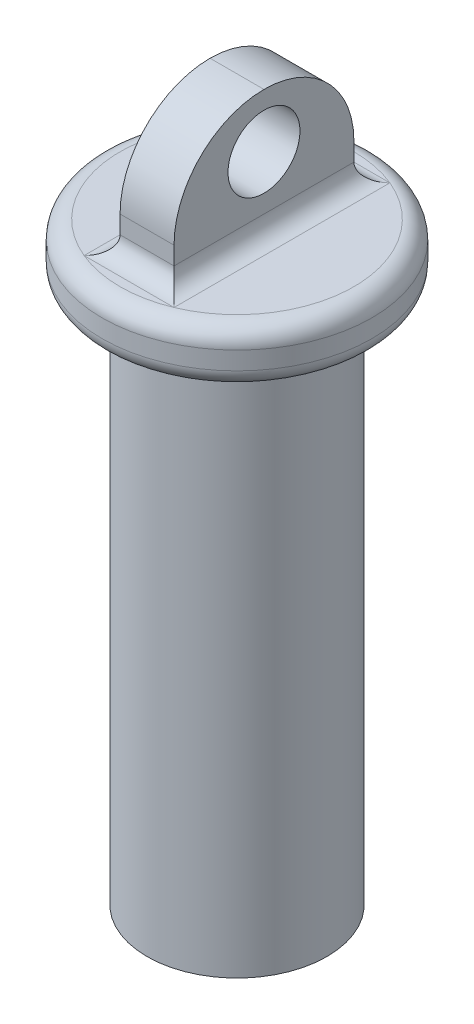
ISO-10303-21;
HEADER;
FILE_DESCRIPTION(('STEP AP214'),'2;1');
FILE_NAME('part.step','',(''),(''),'','','');
FILE_SCHEMA(('AUTOMOTIVE_DESIGN { 1 0 10303 214 1 1 1 1 }'));
ENDSEC;
DATA;
#1=APPLICATION_CONTEXT('core data for automotive mechanical design processes');
#2=APPLICATION_PROTOCOL_DEFINITION('international standard','automotive_design',2000,#1);
#3=PRODUCT_CONTEXT('',#1,'mechanical');
#4=PRODUCT('Part','Part','',(#3));
#5=PRODUCT_RELATED_PRODUCT_CATEGORY('part','',(#4));
#6=PRODUCT_DEFINITION_FORMATION('','',#4);
#7=PRODUCT_DEFINITION_CONTEXT('part definition',#1,'design');
#8=PRODUCT_DEFINITION('design','',#6,#7);
#9=PRODUCT_DEFINITION_SHAPE('','',#8);
#10=(LENGTH_UNIT() NAMED_UNIT(*) SI_UNIT(.MILLI.,.METRE.));
#11=(NAMED_UNIT(*) PLANE_ANGLE_UNIT() SI_UNIT($,.RADIAN.));
#12=(NAMED_UNIT(*) SI_UNIT($,.STERADIAN.) SOLID_ANGLE_UNIT());
#13=UNCERTAINTY_MEASURE_WITH_UNIT(LENGTH_MEASURE(1.E-05),#10,'distance_accuracy_value','');
#14=(GEOMETRIC_REPRESENTATION_CONTEXT(3) GLOBAL_UNCERTAINTY_ASSIGNED_CONTEXT((#13)) GLOBAL_UNIT_ASSIGNED_CONTEXT((#10,
#11,#12)) REPRESENTATION_CONTEXT('',''));
#15=CARTESIAN_POINT('',(0.,0.,0.));
#16=DIRECTION('',(0.,0.,1.));
#17=DIRECTION('',(1.,0.,0.));
#18=AXIS2_PLACEMENT_3D('',#15,#16,#17);
#19=CARTESIAN_POINT('',(0.,33.,0.));
#20=DIRECTION('',(0.,1.,0.));
#21=DIRECTION('',(0.,0.,1.));
#22=AXIS2_PLACEMENT_3D('',#19,#20,#21);
#23=PLANE('',#22);
#24=CARTESIAN_POINT('',(0.,33.,0.));
#25=DIRECTION('',(0.,1.,0.));
#26=DIRECTION('',(0.,0.,1.));
#27=AXIS2_PLACEMENT_3D('',#24,#25,#26);
#28=CIRCLE('',#27,6.5);
#29=CARTESIAN_POINT('',(0.,33.,6.5));
#30=VERTEX_POINT('',#29);
#31=CARTESIAN_POINT('',(2.5,33.,6.));
#32=VERTEX_POINT('',#31);
#33=EDGE_CURVE('E148',#30,#32,#28,.T.);
#34=ORIENTED_EDGE('',*,*,#33,.T.);
#35=DIRECTION('',(1.,0.,0.));
#36=VECTOR('',#35,1.);
#37=CARTESIAN_POINT('',(0.,33.,6.));
#38=LINE('',#37,#36);
#39=CARTESIAN_POINT('',(-2.5,33.,6.));
#40=VERTEX_POINT('',#39);
#41=EDGE_CURVE('E124',#32,#40,#38,.F.);
#42=ORIENTED_EDGE('',*,*,#41,.T.);
#43=CARTESIAN_POINT('',(0.,33.,0.));
#44=DIRECTION('',(0.,1.,0.));
#45=DIRECTION('',(0.,0.,1.));
#46=AXIS2_PLACEMENT_3D('',#43,#44,#45);
#47=CIRCLE('',#46,6.5);
#48=EDGE_CURVE('E129',#40,#30,#47,.T.);
#49=ORIENTED_EDGE('',*,*,#48,.T.);
#50=EDGE_LOOP('',(#34,#42,#49));
#51=FACE_BOUND('',#50,.T.);
#52=ADVANCED_FACE('F33',(#51),#23,.T.);
#53=CARTESIAN_POINT('',(0.,33.,0.));
#54=DIRECTION('',(0.,1.,0.));
#55=DIRECTION('',(0.,0.,1.));
#56=AXIS2_PLACEMENT_3D('',#53,#54,#55);
#57=CIRCLE('',#56,6.5);
#58=CARTESIAN_POINT('',(-2.5,33.,-6.));
#59=VERTEX_POINT('',#58);
#60=EDGE_CURVE('E132',#59,#40,#57,.T.);
#61=ORIENTED_EDGE('',*,*,#60,.T.);
#62=DIRECTION('',(0.,0.,1.));
#63=VECTOR('',#62,1.);
#64=CARTESIAN_POINT('',(-2.5,33.,0.));
#65=LINE('',#64,#63);
#66=EDGE_CURVE('E113',#40,#59,#65,.F.);
#67=ORIENTED_EDGE('',*,*,#66,.T.);
#68=EDGE_LOOP('',(#61,#67));
#69=FACE_BOUND('',#68,.T.);
#70=ADVANCED_FACE('F222',(#69),#23,.T.);
#71=CARTESIAN_POINT('',(0.,33.,0.));
#72=DIRECTION('',(0.,1.,0.));
#73=DIRECTION('',(0.,0.,1.));
#74=AXIS2_PLACEMENT_3D('',#71,#72,#73);
#75=CIRCLE('',#74,6.5);
#76=CARTESIAN_POINT('',(2.5,33.,-6.));
#77=VERTEX_POINT('',#76);
#78=EDGE_CURVE('E142',#77,#59,#75,.T.);
#79=ORIENTED_EDGE('',*,*,#78,.T.);
#80=DIRECTION('',(-1.,0.,0.));
#81=VECTOR('',#80,1.);
#82=CARTESIAN_POINT('',(0.,33.,-6.));
#83=LINE('',#82,#81);
#84=EDGE_CURVE('E154',#59,#77,#83,.F.);
#85=ORIENTED_EDGE('',*,*,#84,.T.);
#86=EDGE_LOOP('',(#79,#85));
#87=FACE_BOUND('',#86,.T.);
#88=ADVANCED_FACE('F229',(#87),#23,.T.);
#89=CARTESIAN_POINT('',(0.,33.,0.));
#90=DIRECTION('',(0.,1.,0.));
#91=DIRECTION('',(0.,0.,1.));
#92=AXIS2_PLACEMENT_3D('',#89,#90,#91);
#93=CIRCLE('',#92,6.5);
#94=EDGE_CURVE('E145',#32,#77,#93,.T.);
#95=ORIENTED_EDGE('',*,*,#94,.T.);
#96=DIRECTION('',(0.,0.,-1.));
#97=VECTOR('',#96,1.);
#98=CARTESIAN_POINT('',(2.5,33.,0.));
#99=LINE('',#98,#97);
#100=EDGE_CURVE('E151',#77,#32,#99,.F.);
#101=ORIENTED_EDGE('',*,*,#100,.T.);
#102=EDGE_LOOP('',(#95,#101));
#103=FACE_BOUND('',#102,.T.);
#104=ADVANCED_FACE('F225',(#103),#23,.T.);
#105=CARTESIAN_POINT('',(0.,30.,0.));
#106=DIRECTION('',(0.,-1.,0.));
#107=DIRECTION('',(0.,0.,-1.));
#108=AXIS2_PLACEMENT_3D('',#105,#106,#107);
#109=CYLINDRICAL_SURFACE('',#108,5.);
#110=CARTESIAN_POINT('',(0.,29.,0.));
#111=DIRECTION('',(0.,1.,0.));
#112=DIRECTION('',(0.,0.,1.));
#113=AXIS2_PLACEMENT_3D('',#110,#111,#112);
#114=CIRCLE('',#113,5.);
#115=CARTESIAN_POINT('',(0.,29.,5.));
#116=VERTEX_POINT('',#115);
#117=EDGE_CURVE('E174',#116,#116,#114,.F.);
#118=ORIENTED_EDGE('',*,*,#117,.T.);
#119=EDGE_LOOP('',(#118));
#120=FACE_BOUND('',#119,.T.);
#121=CARTESIAN_POINT('',(0.,0.,0.));
#122=DIRECTION('',(0.,1.,0.));
#123=DIRECTION('',(0.,0.,1.));
#124=AXIS2_PLACEMENT_3D('',#121,#122,#123);
#125=CIRCLE('',#124,5.);
#126=CARTESIAN_POINT('',(0.,0.,5.));
#127=VERTEX_POINT('',#126);
#128=EDGE_CURVE('E130',#127,#127,#125,.T.);
#129=ORIENTED_EDGE('',*,*,#128,.T.);
#130=EDGE_LOOP('',(#129));
#131=FACE_BOUND('',#130,.T.);
#132=ADVANCED_FACE('F234',(#120,#131),#109,.T.);
#133=CARTESIAN_POINT('',(0.,0.,0.));
#134=DIRECTION('',(0.,1.,0.));
#135=DIRECTION('',(0.,0.,1.));
#136=AXIS2_PLACEMENT_3D('',#133,#134,#135);
#137=PLANE('',#136);
#138=ORIENTED_EDGE('',*,*,#128,.F.);
#139=EDGE_LOOP('',(#138));
#140=FACE_BOUND('',#139,.T.);
#141=ADVANCED_FACE('F240',(#140),#137,.F.);
#142=CARTESIAN_POINT('',(0.,30.,0.));
#143=DIRECTION('',(0.,1.,0.));
#144=DIRECTION('',(0.,0.,1.));
#145=AXIS2_PLACEMENT_3D('',#142,#143,#144);
#146=PLANE('',#145);
#147=CARTESIAN_POINT('',(0.,30.,0.));
#148=DIRECTION('',(0.,1.,0.));
#149=DIRECTION('',(0.,0.,1.));
#150=AXIS2_PLACEMENT_3D('',#147,#148,#149);
#151=CIRCLE('',#150,6.5);
#152=CARTESIAN_POINT('',(0.,30.,6.5));
#153=VERTEX_POINT('',#152);
#154=EDGE_CURVE('E171',#153,#153,#151,.F.);
#155=ORIENTED_EDGE('',*,*,#154,.T.);
#156=EDGE_LOOP('',(#155));
#157=FACE_BOUND('',#156,.T.);
#158=CARTESIAN_POINT('',(0.,30.,0.));
#159=DIRECTION('',(0.,1.,0.));
#160=DIRECTION('',(0.,0.,1.));
#161=AXIS2_PLACEMENT_3D('',#158,#159,#160);
#162=CIRCLE('',#161,6.);
#163=CARTESIAN_POINT('',(0.,30.,6.));
#164=VERTEX_POINT('',#163);
#165=EDGE_CURVE('E168',#164,#164,#162,.T.);
#166=ORIENTED_EDGE('',*,*,#165,.T.);
#167=EDGE_LOOP('',(#166));
#168=FACE_BOUND('',#167,.T.);
#169=ADVANCED_FACE('F333',(#157,#168),#146,.F.);
#170=CARTESIAN_POINT('',(0.,33.,0.));
#171=DIRECTION('',(0.,-1.,0.));
#172=DIRECTION('',(0.,0.,-1.));
#173=AXIS2_PLACEMENT_3D('',#170,#171,#172);
#174=CYLINDRICAL_SURFACE('',#173,7.5);
#175=CARTESIAN_POINT('',(0.,32.,0.));
#176=DIRECTION('',(0.,1.,0.));
#177=DIRECTION('',(0.,0.,1.));
#178=AXIS2_PLACEMENT_3D('',#175,#176,#177);
#179=CIRCLE('',#178,7.5);
#180=CARTESIAN_POINT('',(0.,32.,7.5));
#181=VERTEX_POINT('',#180);
#182=EDGE_CURVE('E165',#181,#181,#179,.F.);
#183=ORIENTED_EDGE('',*,*,#182,.T.);
#184=EDGE_LOOP('',(#183));
#185=FACE_BOUND('',#184,.T.);
#186=CARTESIAN_POINT('',(0.,31.,0.));
#187=DIRECTION('',(0.,1.,0.));
#188=DIRECTION('',(0.,0.,1.));
#189=AXIS2_PLACEMENT_3D('',#186,#187,#188);
#190=CIRCLE('',#189,7.5);
#191=CARTESIAN_POINT('',(0.,31.,7.5));
#192=VERTEX_POINT('',#191);
#193=EDGE_CURVE('E162',#192,#192,#190,.T.);
#194=ORIENTED_EDGE('',*,*,#193,.T.);
#195=EDGE_LOOP('',(#194));
#196=FACE_BOUND('',#195,.T.);
#197=ADVANCED_FACE('F328',(#185,#196),#174,.T.);
#198=CARTESIAN_POINT('',(1.5,40.,-5.));
#199=DIRECTION('',(-1.,0.,0.));
#200=DIRECTION('',(0.,0.,1.));
#201=AXIS2_PLACEMENT_3D('',#198,#199,#200);
#202=PLANE('',#201);
#203=CARTESIAN_POINT('',(1.5,37.,0.));
#204=DIRECTION('',(1.,0.,0.));
#205=DIRECTION('',(0.,0.,-1.));
#206=AXIS2_PLACEMENT_3D('',#203,#204,#205);
#207=CIRCLE('',#206,2.);
#208=CARTESIAN_POINT('',(1.5,37.,-2.));
#209=VERTEX_POINT('',#208);
#210=EDGE_CURVE('E183',#209,#209,#207,.T.);
#211=ORIENTED_EDGE('',*,*,#210,.F.);
#212=EDGE_LOOP('',(#211));
#213=FACE_BOUND('',#212,.T.);
#214=DIRECTION('',(0.,-1.,0.));
#215=VECTOR('',#214,1.);
#216=CARTESIAN_POINT('',(1.5,40.,-5.));
#217=LINE('',#216,#215);
#218=CARTESIAN_POINT('',(1.5,35.,-5.));
#219=VERTEX_POINT('',#218);
#220=CARTESIAN_POINT('',(1.5,34.,-5.));
#221=VERTEX_POINT('',#220);
#222=EDGE_CURVE('E135',#219,#221,#217,.T.);
#223=ORIENTED_EDGE('',*,*,#222,.F.);
#224=CARTESIAN_POINT('',(1.5,35.,0.));
#225=DIRECTION('',(-1.,0.,0.));
#226=DIRECTION('',(0.,0.,1.));
#227=AXIS2_PLACEMENT_3D('',#224,#225,#226);
#228=CIRCLE('',#227,5.);
#229=CARTESIAN_POINT('',(1.5,40.,0.));
#230=VERTEX_POINT('',#229);
#231=EDGE_CURVE('E42',#219,#230,#228,.F.);
#232=ORIENTED_EDGE('',*,*,#231,.T.);
#233=CARTESIAN_POINT('',(1.5,35.,0.));
#234=DIRECTION('',(-1.,0.,0.));
#235=DIRECTION('',(0.,0.,1.));
#236=AXIS2_PLACEMENT_3D('',#233,#234,#235);
#237=CIRCLE('',#236,5.);
#238=CARTESIAN_POINT('',(1.5,35.,5.));
#239=VERTEX_POINT('',#238);
#240=EDGE_CURVE('E52',#230,#239,#237,.F.);
#241=ORIENTED_EDGE('',*,*,#240,.T.);
#242=DIRECTION('',(0.,-1.,0.));
#243=VECTOR('',#242,1.);
#244=CARTESIAN_POINT('',(1.5,40.,5.));
#245=LINE('',#244,#243);
#246=CARTESIAN_POINT('',(1.5,34.,5.));
#247=VERTEX_POINT('',#246);
#248=EDGE_CURVE('E103',#239,#247,#245,.T.);
#249=ORIENTED_EDGE('',*,*,#248,.T.);
#250=DIRECTION('',(0.,0.,-1.));
#251=VECTOR('',#250,1.);
#252=CARTESIAN_POINT('',(1.5,34.,-5.));
#253=LINE('',#252,#251);
#254=EDGE_CURVE('E123',#247,#221,#253,.T.);
#255=ORIENTED_EDGE('',*,*,#254,.T.);
#256=EDGE_LOOP('',(#223,#232,#241,#249,#255));
#257=FACE_BOUND('',#256,.T.);
#258=ADVANCED_FACE('F196',(#213,#257),#202,.F.);
#259=CARTESIAN_POINT('',(-1.5,40.,-5.));
#260=DIRECTION('',(0.,0.,1.));
#261=DIRECTION('',(1.,0.,0.));
#262=AXIS2_PLACEMENT_3D('',#259,#260,#261);
#263=PLANE('',#262);
#264=DIRECTION('',(0.,-1.,0.));
#265=VECTOR('',#264,1.);
#266=CARTESIAN_POINT('',(-1.5,40.,-5.));
#267=LINE('',#266,#265);
#268=CARTESIAN_POINT('',(-1.5,35.,-5.));
#269=VERTEX_POINT('',#268);
#270=CARTESIAN_POINT('',(-1.5,34.,-5.));
#271=VERTEX_POINT('',#270);
#272=EDGE_CURVE('E102',#269,#271,#267,.T.);
#273=ORIENTED_EDGE('',*,*,#272,.F.);
#274=DIRECTION('',(-1.,0.,0.));
#275=VECTOR('',#274,1.);
#276=CARTESIAN_POINT('',(1.5,35.,-5.));
#277=LINE('',#276,#275);
#278=EDGE_CURVE('E187',#269,#219,#277,.F.);
#279=ORIENTED_EDGE('',*,*,#278,.T.);
#280=ORIENTED_EDGE('',*,*,#222,.T.);
#281=DIRECTION('',(-1.,0.,0.));
#282=VECTOR('',#281,1.);
#283=CARTESIAN_POINT('',(-1.5,34.,-5.));
#284=LINE('',#283,#282);
#285=EDGE_CURVE('E160',#221,#271,#284,.T.);
#286=ORIENTED_EDGE('',*,*,#285,.T.);
#287=EDGE_LOOP('',(#273,#279,#280,#286));
#288=FACE_BOUND('',#287,.T.);
#289=ADVANCED_FACE('F193',(#288),#263,.F.);
#290=CARTESIAN_POINT('',(-1.5,40.,-5.));
#291=DIRECTION('',(1.,0.,0.));
#292=DIRECTION('',(0.,0.,-1.));
#293=AXIS2_PLACEMENT_3D('',#290,#291,#292);
#294=PLANE('',#293);
#295=CARTESIAN_POINT('',(-1.5,37.,0.));
#296=DIRECTION('',(1.,0.,0.));
#297=DIRECTION('',(0.,0.,-1.));
#298=AXIS2_PLACEMENT_3D('',#295,#296,#297);
#299=CIRCLE('',#298,2.);
#300=CARTESIAN_POINT('',(-1.5,37.,-2.));
#301=VERTEX_POINT('',#300);
#302=EDGE_CURVE('E138',#301,#301,#299,.T.);
#303=ORIENTED_EDGE('',*,*,#302,.T.);
#304=EDGE_LOOP('',(#303));
#305=FACE_BOUND('',#304,.T.);
#306=CARTESIAN_POINT('',(-1.5,35.,0.));
#307=DIRECTION('',(1.,0.,0.));
#308=DIRECTION('',(0.,0.,-1.));
#309=AXIS2_PLACEMENT_3D('',#306,#307,#308);
#310=CIRCLE('',#309,5.);
#311=CARTESIAN_POINT('',(-1.5,35.,5.));
#312=VERTEX_POINT('',#311);
#313=CARTESIAN_POINT('',(-1.5,40.,0.));
#314=VERTEX_POINT('',#313);
#315=EDGE_CURVE('E176',#312,#314,#310,.F.);
#316=ORIENTED_EDGE('',*,*,#315,.T.);
#317=CARTESIAN_POINT('',(-1.5,35.,0.));
#318=DIRECTION('',(1.,0.,0.));
#319=DIRECTION('',(0.,0.,-1.));
#320=AXIS2_PLACEMENT_3D('',#317,#318,#319);
#321=CIRCLE('',#320,5.);
#322=EDGE_CURVE('E185',#314,#269,#321,.F.);
#323=ORIENTED_EDGE('',*,*,#322,.T.);
#324=ORIENTED_EDGE('',*,*,#272,.T.);
#325=DIRECTION('',(0.,0.,1.));
#326=VECTOR('',#325,1.);
#327=CARTESIAN_POINT('',(-1.5,34.,-5.));
#328=LINE('',#327,#326);
#329=CARTESIAN_POINT('',(-1.5,34.,5.));
#330=VERTEX_POINT('',#329);
#331=EDGE_CURVE('E111',#271,#330,#328,.T.);
#332=ORIENTED_EDGE('',*,*,#331,.T.);
#333=DIRECTION('',(0.,-1.,0.));
#334=VECTOR('',#333,1.);
#335=CARTESIAN_POINT('',(-1.5,40.,5.));
#336=LINE('',#335,#334);
#337=EDGE_CURVE('E92',#312,#330,#336,.T.);
#338=ORIENTED_EDGE('',*,*,#337,.F.);
#339=EDGE_LOOP('',(#316,#323,#324,#332,#338));
#340=FACE_BOUND('',#339,.T.);
#341=ADVANCED_FACE('F126',(#305,#340),#294,.F.);
#342=CARTESIAN_POINT('',(-1.5,40.,5.));
#343=DIRECTION('',(0.,0.,-1.));
#344=DIRECTION('',(-1.,0.,0.));
#345=AXIS2_PLACEMENT_3D('',#342,#343,#344);
#346=PLANE('',#345);
#347=ORIENTED_EDGE('',*,*,#248,.F.);
#348=DIRECTION('',(1.,0.,0.));
#349=VECTOR('',#348,1.);
#350=CARTESIAN_POINT('',(-1.5,35.,5.));
#351=LINE('',#350,#349);
#352=EDGE_CURVE('E11',#239,#312,#351,.F.);
#353=ORIENTED_EDGE('',*,*,#352,.T.);
#354=ORIENTED_EDGE('',*,*,#337,.T.);
#355=DIRECTION('',(1.,0.,0.));
#356=VECTOR('',#355,1.);
#357=CARTESIAN_POINT('',(-1.5,34.,5.));
#358=LINE('',#357,#356);
#359=EDGE_CURVE('E96',#330,#247,#358,.T.);
#360=ORIENTED_EDGE('',*,*,#359,.T.);
#361=EDGE_LOOP('',(#347,#353,#354,#360));
#362=FACE_BOUND('',#361,.T.);
#363=ADVANCED_FACE('F94',(#362),#346,.F.);
#364=CARTESIAN_POINT('',(-5.5,37.,0.));
#365=DIRECTION('',(1.,0.,0.));
#366=DIRECTION('',(0.,0.,-1.));
#367=AXIS2_PLACEMENT_3D('',#364,#365,#366);
#368=CYLINDRICAL_SURFACE('',#367,2.);
#369=ORIENTED_EDGE('',*,*,#210,.T.);
#370=EDGE_LOOP('',(#369));
#371=FACE_BOUND('',#370,.T.);
#372=ORIENTED_EDGE('',*,*,#302,.F.);
#373=EDGE_LOOP('',(#372));
#374=FACE_BOUND('',#373,.T.);
#375=ADVANCED_FACE('F209',(#371,#374),#368,.F.);
#376=CARTESIAN_POINT('',(2.5,34.,-5.));
#377=DIRECTION('',(0.,0.,-1.));
#378=DIRECTION('',(-1.,0.,0.));
#379=AXIS2_PLACEMENT_3D('',#376,#377,#378);
#380=CYLINDRICAL_SURFACE('',#379,1.);
#381=CARTESIAN_POINT('',(2.5,34.,6.));
#382=DIRECTION('',(0.707106781186547,0.,-0.707106781186548));
#383=DIRECTION('',(-0.707106781186548,0.,-0.707106781186547));
#384=AXIS2_PLACEMENT_3D('',#381,#382,#383);
#385=ELLIPSE('',#384,1.4142135623731,1.);
#386=EDGE_CURVE('E122',#32,#247,#385,.T.);
#387=ORIENTED_EDGE('',*,*,#386,.F.);
#388=ORIENTED_EDGE('',*,*,#100,.F.);
#389=CARTESIAN_POINT('',(2.5,34.,-6.));
#390=DIRECTION('',(-0.707106781186548,0.,-0.707106781186547));
#391=DIRECTION('',(-0.707106781186547,0.,0.707106781186548));
#392=AXIS2_PLACEMENT_3D('',#389,#390,#391);
#393=ELLIPSE('',#392,1.41421356237309,1.);
#394=EDGE_CURVE('E180',#221,#77,#393,.F.);
#395=ORIENTED_EDGE('',*,*,#394,.F.);
#396=ORIENTED_EDGE('',*,*,#254,.F.);
#397=EDGE_LOOP('',(#387,#388,#395,#396));
#398=FACE_BOUND('',#397,.T.);
#399=ADVANCED_FACE('F211',(#398),#380,.F.);
#400=CARTESIAN_POINT('',(-1.5,34.,-6.));
#401=DIRECTION('',(-1.,0.,0.));
#402=DIRECTION('',(0.,0.,1.));
#403=AXIS2_PLACEMENT_3D('',#400,#401,#402);
#404=CYLINDRICAL_SURFACE('',#403,1.);
#405=ORIENTED_EDGE('',*,*,#394,.T.);
#406=ORIENTED_EDGE('',*,*,#84,.F.);
#407=CARTESIAN_POINT('',(-2.5,34.,-6.));
#408=DIRECTION('',(-0.707106781186547,0.,0.707106781186548));
#409=DIRECTION('',(-0.707106781186548,0.,-0.707106781186547));
#410=AXIS2_PLACEMENT_3D('',#407,#408,#409);
#411=ELLIPSE('',#410,1.4142135623731,1.);
#412=EDGE_CURVE('E117',#271,#59,#411,.F.);
#413=ORIENTED_EDGE('',*,*,#412,.F.);
#414=ORIENTED_EDGE('',*,*,#285,.F.);
#415=EDGE_LOOP('',(#405,#406,#413,#414));
#416=FACE_BOUND('',#415,.T.);
#417=ADVANCED_FACE('F217',(#416),#404,.F.);
#418=CARTESIAN_POINT('',(-1.5,34.,6.));
#419=DIRECTION('',(1.,0.,0.));
#420=DIRECTION('',(0.,0.,-1.));
#421=AXIS2_PLACEMENT_3D('',#418,#419,#420);
#422=CYLINDRICAL_SURFACE('',#421,1.);
#423=ORIENTED_EDGE('',*,*,#386,.T.);
#424=ORIENTED_EDGE('',*,*,#359,.F.);
#425=CARTESIAN_POINT('',(-2.5,34.,6.));
#426=DIRECTION('',(0.707106781186548,0.,0.707106781186547));
#427=DIRECTION('',(0.707106781186547,0.,-0.707106781186548));
#428=AXIS2_PLACEMENT_3D('',#425,#426,#427);
#429=ELLIPSE('',#428,1.41421356237309,1.);
#430=EDGE_CURVE('E109',#40,#330,#429,.T.);
#431=ORIENTED_EDGE('',*,*,#430,.F.);
#432=ORIENTED_EDGE('',*,*,#41,.F.);
#433=EDGE_LOOP('',(#423,#424,#431,#432));
#434=FACE_BOUND('',#433,.T.);
#435=ADVANCED_FACE('F120',(#434),#422,.F.);
#436=CARTESIAN_POINT('',(-2.5,34.,-5.));
#437=DIRECTION('',(0.,0.,1.));
#438=DIRECTION('',(1.,0.,0.));
#439=AXIS2_PLACEMENT_3D('',#436,#437,#438);
#440=CYLINDRICAL_SURFACE('',#439,1.);
#441=ORIENTED_EDGE('',*,*,#412,.T.);
#442=ORIENTED_EDGE('',*,*,#66,.F.);
#443=ORIENTED_EDGE('',*,*,#430,.T.);
#444=ORIENTED_EDGE('',*,*,#331,.F.);
#445=EDGE_LOOP('',(#441,#442,#443,#444));
#446=FACE_BOUND('',#445,.T.);
#447=ADVANCED_FACE('F110',(#446),#440,.F.);
#448=CARTESIAN_POINT('',(0.,32.,0.));
#449=DIRECTION('',(0.,1.,0.));
#450=DIRECTION('',(0.,0.,1.));
#451=AXIS2_PLACEMENT_3D('',#448,#449,#450);
#452=TOROIDAL_SURFACE('',#451,6.5,1.);
#453=ORIENTED_EDGE('',*,*,#182,.F.);
#454=EDGE_LOOP('',(#453));
#455=FACE_BOUND('',#454,.T.);
#456=ORIENTED_EDGE('',*,*,#94,.F.);
#457=ORIENTED_EDGE('',*,*,#33,.F.);
#458=ORIENTED_EDGE('',*,*,#48,.F.);
#459=ORIENTED_EDGE('',*,*,#60,.F.);
#460=ORIENTED_EDGE('',*,*,#78,.F.);
#461=EDGE_LOOP('',(#456,#457,#458,#459,#460));
#462=FACE_BOUND('',#461,.T.);
#463=ADVANCED_FACE('F253',(#455,#462),#452,.T.);
#464=CARTESIAN_POINT('',(0.,31.,0.));
#465=DIRECTION('',(0.,1.,0.));
#466=DIRECTION('',(0.,0.,1.));
#467=AXIS2_PLACEMENT_3D('',#464,#465,#466);
#468=TOROIDAL_SURFACE('',#467,6.5,1.);
#469=ORIENTED_EDGE('',*,*,#154,.F.);
#470=EDGE_LOOP('',(#469));
#471=FACE_BOUND('',#470,.T.);
#472=ORIENTED_EDGE('',*,*,#193,.F.);
#473=EDGE_LOOP('',(#472));
#474=FACE_BOUND('',#473,.T.);
#475=ADVANCED_FACE('F255',(#471,#474),#468,.T.);
#476=CARTESIAN_POINT('',(0.,29.,0.));
#477=DIRECTION('',(0.,1.,0.));
#478=DIRECTION('',(0.,0.,1.));
#479=AXIS2_PLACEMENT_3D('',#476,#477,#478);
#480=TOROIDAL_SURFACE('',#479,6.,1.);
#481=ORIENTED_EDGE('',*,*,#117,.F.);
#482=EDGE_LOOP('',(#481));
#483=FACE_BOUND('',#482,.T.);
#484=ORIENTED_EDGE('',*,*,#165,.F.);
#485=EDGE_LOOP('',(#484));
#486=FACE_BOUND('',#485,.T.);
#487=ADVANCED_FACE('F262',(#483,#486),#480,.F.);
#488=CARTESIAN_POINT('',(0.,35.,0.));
#489=DIRECTION('',(-1.,0.,0.));
#490=DIRECTION('',(0.,0.,1.));
#491=AXIS2_PLACEMENT_3D('',#488,#489,#490);
#492=CYLINDRICAL_SURFACE('',#491,5.);
#493=ORIENTED_EDGE('',*,*,#352,.F.);
#494=ORIENTED_EDGE('',*,*,#240,.F.);
#495=DIRECTION('',(1.,0.,0.));
#496=VECTOR('',#495,1.);
#497=CARTESIAN_POINT('',(1.5,40.,0.));
#498=LINE('',#497,#496);
#499=EDGE_CURVE('E37',#314,#230,#498,.T.);
#500=ORIENTED_EDGE('',*,*,#499,.F.);
#501=ORIENTED_EDGE('',*,*,#315,.F.);
#502=EDGE_LOOP('',(#493,#494,#500,#501));
#503=FACE_BOUND('',#502,.T.);
#504=ADVANCED_FACE('F35',(#503),#492,.T.);
#505=CARTESIAN_POINT('',(0.,35.,0.));
#506=DIRECTION('',(1.,0.,0.));
#507=DIRECTION('',(0.,0.,-1.));
#508=AXIS2_PLACEMENT_3D('',#505,#506,#507);
#509=CYLINDRICAL_SURFACE('',#508,5.);
#510=ORIENTED_EDGE('',*,*,#231,.F.);
#511=ORIENTED_EDGE('',*,*,#278,.F.);
#512=ORIENTED_EDGE('',*,*,#322,.F.);
#513=ORIENTED_EDGE('',*,*,#499,.T.);
#514=EDGE_LOOP('',(#510,#511,#512,#513));
#515=FACE_BOUND('',#514,.T.);
#516=ADVANCED_FACE('F271',(#515),#509,.T.);
#517=CLOSED_SHELL('',(#52,#70,#88,#104,#132,#141,#169,#197,#258,#289,#341,#363,#375,#399,#417,
#435,#447,#463,#475,#487,#504,#516));
#518=MANIFOLD_SOLID_BREP('B2',#517);
#519=ADVANCED_BREP_SHAPE_REPRESENTATION('',(#18,#518),#14);
#520=SHAPE_DEFINITION_REPRESENTATION(#9,#519);
ENDSEC;
END-ISO-10303-21;
